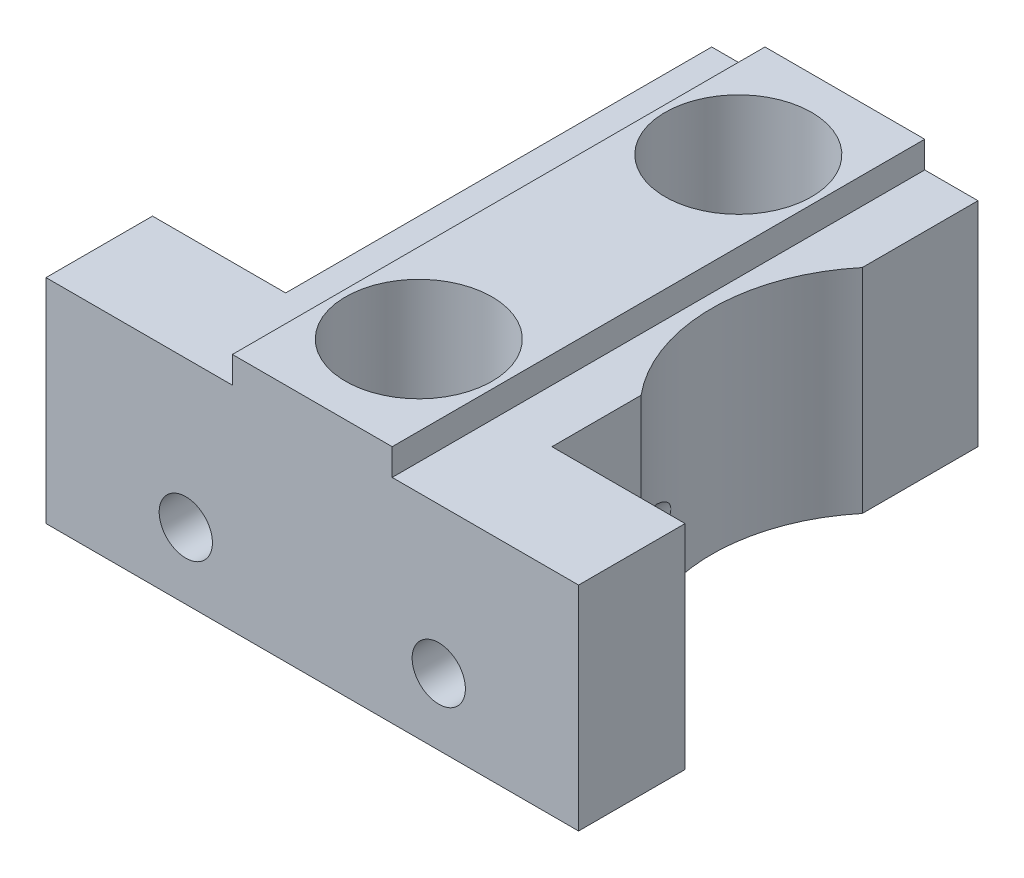
ISO-10303-21;
HEADER;
FILE_DESCRIPTION(('STEP AP214'),'2;1');
FILE_NAME('part.step','',(''),(''),'','','');
FILE_SCHEMA(('AUTOMOTIVE_DESIGN { 1 0 10303 214 1 1 1 1 }'));
ENDSEC;
DATA;
#1=APPLICATION_CONTEXT('core data for automotive mechanical design processes');
#2=APPLICATION_PROTOCOL_DEFINITION('international standard','automotive_design',2000,#1);
#3=PRODUCT_CONTEXT('',#1,'mechanical');
#4=PRODUCT('Part','Part','',(#3));
#5=PRODUCT_RELATED_PRODUCT_CATEGORY('part','',(#4));
#6=PRODUCT_DEFINITION_FORMATION('','',#4);
#7=PRODUCT_DEFINITION_CONTEXT('part definition',#1,'design');
#8=PRODUCT_DEFINITION('design','',#6,#7);
#9=PRODUCT_DEFINITION_SHAPE('','',#8);
#10=(LENGTH_UNIT() NAMED_UNIT(*) SI_UNIT(.MILLI.,.METRE.));
#11=(NAMED_UNIT(*) PLANE_ANGLE_UNIT() SI_UNIT($,.RADIAN.));
#12=(NAMED_UNIT(*) SI_UNIT($,.STERADIAN.) SOLID_ANGLE_UNIT());
#13=UNCERTAINTY_MEASURE_WITH_UNIT(LENGTH_MEASURE(1.E-05),#10,'distance_accuracy_value','');
#14=(GEOMETRIC_REPRESENTATION_CONTEXT(3) GLOBAL_UNCERTAINTY_ASSIGNED_CONTEXT((#13)) GLOBAL_UNIT_ASSIGNED_CONTEXT((#10,
#11,#12)) REPRESENTATION_CONTEXT('',''));
#15=CARTESIAN_POINT('',(0.,0.,0.));
#16=DIRECTION('',(0.,0.,1.));
#17=DIRECTION('',(1.,0.,0.));
#18=AXIS2_PLACEMENT_3D('',#15,#16,#17);
#19=CARTESIAN_POINT('',(5.,8.,-4.));
#20=DIRECTION('',(-1.,0.,0.));
#21=DIRECTION('',(0.,0.,1.));
#22=AXIS2_PLACEMENT_3D('',#19,#20,#21);
#23=PLANE('',#22);
#24=DIRECTION('',(0.,-1.,0.));
#25=VECTOR('',#24,1.);
#26=CARTESIAN_POINT('',(5.,9.,-7.34668806854097));
#27=LINE('',#26,#25);
#28=CARTESIAN_POINT('',(5.,0.,-7.34668806854097));
#29=VERTEX_POINT('',#28);
#30=CARTESIAN_POINT('',(5.,1.53175416344815,-7.34668806854097));
#31=VERTEX_POINT('',#30);
#32=EDGE_CURVE('E181',#29,#31,#27,.F.);
#33=ORIENTED_EDGE('',*,*,#32,.T.);
#34=DIRECTION('',(0.,0.,1.));
#35=VECTOR('',#34,1.);
#36=CARTESIAN_POINT('',(5.,1.53175416344815,-12.));
#37=LINE('',#36,#35);
#38=CARTESIAN_POINT('',(5.,1.53175416344815,-4.));
#39=VERTEX_POINT('',#38);
#40=EDGE_CURVE('E53',#31,#39,#37,.T.);
#41=ORIENTED_EDGE('',*,*,#40,.T.);
#42=DIRECTION('',(0.,-1.,0.));
#43=VECTOR('',#42,1.);
#44=CARTESIAN_POINT('',(5.,8.,-4.));
#45=LINE('',#44,#43);
#46=CARTESIAN_POINT('',(5.,0.,-4.));
#47=VERTEX_POINT('',#46);
#48=EDGE_CURVE('E271',#39,#47,#45,.T.);
#49=ORIENTED_EDGE('',*,*,#48,.T.);
#50=DIRECTION('',(0.,0.,-1.));
#51=VECTOR('',#50,1.);
#52=CARTESIAN_POINT('',(5.,0.,-4.));
#53=LINE('',#52,#51);
#54=EDGE_CURVE('E250',#47,#29,#53,.T.);
#55=ORIENTED_EDGE('',*,*,#54,.T.);
#56=EDGE_LOOP('',(#33,#41,#49,#55));
#57=FACE_BOUND('',#56,.T.);
#58=ADVANCED_FACE('F33',(#57),#23,.F.);
#59=DIRECTION('',(0.,0.,-1.));
#60=VECTOR('',#59,1.);
#61=CARTESIAN_POINT('',(5.,8.,-4.));
#62=LINE('',#61,#60);
#63=CARTESIAN_POINT('',(5.,8.,-15.653311931459));
#64=VERTEX_POINT('',#63);
#65=CARTESIAN_POINT('',(5.,8.,-20.));
#66=VERTEX_POINT('',#65);
#67=EDGE_CURVE('E229',#64,#66,#62,.T.);
#68=ORIENTED_EDGE('',*,*,#67,.F.);
#69=DIRECTION('',(0.,-1.,0.));
#70=VECTOR('',#69,1.);
#71=CARTESIAN_POINT('',(5.,9.,-15.653311931459));
#72=LINE('',#71,#70);
#73=CARTESIAN_POINT('',(5.,0.,-15.653311931459));
#74=VERTEX_POINT('',#73);
#75=EDGE_CURVE('E183',#64,#74,#72,.T.);
#76=ORIENTED_EDGE('',*,*,#75,.T.);
#77=CARTESIAN_POINT('',(5.,0.,-20.));
#78=VERTEX_POINT('',#77);
#79=EDGE_CURVE('E249',#74,#78,#53,.T.);
#80=ORIENTED_EDGE('',*,*,#79,.T.);
#81=DIRECTION('',(0.,-1.,0.));
#82=VECTOR('',#81,1.);
#83=CARTESIAN_POINT('',(5.,8.,-20.));
#84=LINE('',#83,#82);
#85=EDGE_CURVE('E268',#66,#78,#84,.T.);
#86=ORIENTED_EDGE('',*,*,#85,.F.);
#87=EDGE_LOOP('',(#68,#76,#80,#86));
#88=FACE_BOUND('',#87,.T.);
#89=ADVANCED_FACE('F317',(#88),#23,.F.);
#90=CARTESIAN_POINT('',(0.,8.,0.));
#91=DIRECTION('',(0.,1.,0.));
#92=DIRECTION('',(0.,0.,1.));
#93=AXIS2_PLACEMENT_3D('',#90,#91,#92);
#94=PLANE('',#93);
#95=DIRECTION('',(0.,0.,1.));
#96=VECTOR('',#95,1.);
#97=CARTESIAN_POINT('',(-3.,8.,-20.));
#98=LINE('',#97,#96);
#99=CARTESIAN_POINT('',(-3.,8.,-20.));
#100=VERTEX_POINT('',#99);
#101=CARTESIAN_POINT('',(-3.,8.,0.));
#102=VERTEX_POINT('',#101);
#103=EDGE_CURVE('E190',#100,#102,#98,.T.);
#104=ORIENTED_EDGE('',*,*,#103,.F.);
#105=DIRECTION('',(-1.,0.,0.));
#106=VECTOR('',#105,1.);
#107=CARTESIAN_POINT('',(5.,8.,-20.));
#108=LINE('',#107,#106);
#109=CARTESIAN_POINT('',(-5.,8.,-20.));
#110=VERTEX_POINT('',#109);
#111=EDGE_CURVE('E232',#100,#110,#108,.T.);
#112=ORIENTED_EDGE('',*,*,#111,.T.);
#113=DIRECTION('',(0.,0.,1.));
#114=VECTOR('',#113,1.);
#115=CARTESIAN_POINT('',(-5.,8.,-20.));
#116=LINE('',#115,#114);
#117=CARTESIAN_POINT('',(-5.,8.,-4.));
#118=VERTEX_POINT('',#117);
#119=EDGE_CURVE('E235',#110,#118,#116,.T.);
#120=ORIENTED_EDGE('',*,*,#119,.T.);
#121=DIRECTION('',(-1.,0.,0.));
#122=VECTOR('',#121,1.);
#123=CARTESIAN_POINT('',(-5.,8.,-4.));
#124=LINE('',#123,#122);
#125=CARTESIAN_POINT('',(-10.,8.,-4.));
#126=VERTEX_POINT('',#125);
#127=EDGE_CURVE('E237',#118,#126,#124,.T.);
#128=ORIENTED_EDGE('',*,*,#127,.T.);
#129=DIRECTION('',(0.,0.,1.));
#130=VECTOR('',#129,1.);
#131=CARTESIAN_POINT('',(-10.,8.,-4.));
#132=LINE('',#131,#130);
#133=CARTESIAN_POINT('',(-10.,8.,0.));
#134=VERTEX_POINT('',#133);
#135=EDGE_CURVE('E218',#126,#134,#132,.T.);
#136=ORIENTED_EDGE('',*,*,#135,.T.);
#137=DIRECTION('',(1.,0.,0.));
#138=VECTOR('',#137,1.);
#139=CARTESIAN_POINT('',(-10.,8.,0.));
#140=LINE('',#139,#138);
#141=EDGE_CURVE('E223',#134,#102,#140,.T.);
#142=ORIENTED_EDGE('',*,*,#141,.T.);
#143=EDGE_LOOP('',(#104,#112,#120,#128,#136,#142));
#144=FACE_BOUND('',#143,.T.);
#145=ADVANCED_FACE('F332',(#144),#94,.T.);
#146=CARTESIAN_POINT('',(-10.,8.,-4.));
#147=DIRECTION('',(1.,0.,0.));
#148=DIRECTION('',(0.,0.,-1.));
#149=AXIS2_PLACEMENT_3D('',#146,#147,#148);
#150=PLANE('',#149);
#151=DIRECTION('',(0.,0.,1.));
#152=VECTOR('',#151,1.);
#153=CARTESIAN_POINT('',(-10.,0.,-4.));
#154=LINE('',#153,#152);
#155=CARTESIAN_POINT('',(-10.,0.,-4.));
#156=VERTEX_POINT('',#155);
#157=CARTESIAN_POINT('',(-10.,0.,0.));
#158=VERTEX_POINT('',#157);
#159=EDGE_CURVE('E217',#156,#158,#154,.T.);
#160=ORIENTED_EDGE('',*,*,#159,.T.);
#161=DIRECTION('',(0.,-1.,0.));
#162=VECTOR('',#161,1.);
#163=CARTESIAN_POINT('',(-10.,8.,0.));
#164=LINE('',#163,#162);
#165=EDGE_CURVE('E279',#134,#158,#164,.T.);
#166=ORIENTED_EDGE('',*,*,#165,.F.);
#167=ORIENTED_EDGE('',*,*,#135,.F.);
#168=DIRECTION('',(0.,-1.,0.));
#169=VECTOR('',#168,1.);
#170=CARTESIAN_POINT('',(-10.,8.,-4.));
#171=LINE('',#170,#169);
#172=EDGE_CURVE('E239',#126,#156,#171,.T.);
#173=ORIENTED_EDGE('',*,*,#172,.T.);
#174=EDGE_LOOP('',(#160,#166,#167,#173));
#175=FACE_BOUND('',#174,.T.);
#176=ADVANCED_FACE('F35',(#175),#150,.F.);
#177=CARTESIAN_POINT('',(-10.,8.,0.));
#178=DIRECTION('',(0.,0.,-1.));
#179=DIRECTION('',(-1.,0.,0.));
#180=AXIS2_PLACEMENT_3D('',#177,#178,#179);
#181=PLANE('',#180);
#182=CARTESIAN_POINT('',(4.75,2.5,0.));
#183=DIRECTION('',(0.,0.,1.));
#184=DIRECTION('',(1.,0.,0.));
#185=AXIS2_PLACEMENT_3D('',#182,#183,#184);
#186=CIRCLE('',#185,1.);
#187=CARTESIAN_POINT('',(5.75,2.5,0.));
#188=VERTEX_POINT('',#187);
#189=EDGE_CURVE('E175',#188,#188,#186,.T.);
#190=ORIENTED_EDGE('',*,*,#189,.F.);
#191=EDGE_LOOP('',(#190));
#192=FACE_BOUND('',#191,.T.);
#193=CARTESIAN_POINT('',(-4.75,2.5,0.));
#194=DIRECTION('',(0.,0.,1.));
#195=DIRECTION('',(1.,0.,0.));
#196=AXIS2_PLACEMENT_3D('',#193,#194,#195);
#197=CIRCLE('',#196,1.);
#198=CARTESIAN_POINT('',(-3.75,2.5,0.));
#199=VERTEX_POINT('',#198);
#200=EDGE_CURVE('E292',#199,#199,#197,.T.);
#201=ORIENTED_EDGE('',*,*,#200,.F.);
#202=EDGE_LOOP('',(#201));
#203=FACE_BOUND('',#202,.T.);
#204=DIRECTION('',(1.,0.,0.));
#205=VECTOR('',#204,1.);
#206=CARTESIAN_POINT('',(-10.,0.,0.));
#207=LINE('',#206,#205);
#208=CARTESIAN_POINT('',(10.,0.,0.));
#209=VERTEX_POINT('',#208);
#210=EDGE_CURVE('E242',#158,#209,#207,.T.);
#211=ORIENTED_EDGE('',*,*,#210,.T.);
#212=DIRECTION('',(0.,-1.,0.));
#213=VECTOR('',#212,1.);
#214=CARTESIAN_POINT('',(10.,8.,0.));
#215=LINE('',#214,#213);
#216=CARTESIAN_POINT('',(10.,8.,0.));
#217=VERTEX_POINT('',#216);
#218=EDGE_CURVE('E276',#217,#209,#215,.T.);
#219=ORIENTED_EDGE('',*,*,#218,.F.);
#220=CARTESIAN_POINT('',(3.,8.,0.));
#221=VERTEX_POINT('',#220);
#222=EDGE_CURVE('E221',#221,#217,#140,.T.);
#223=ORIENTED_EDGE('',*,*,#222,.F.);
#224=DIRECTION('',(0.,-1.,0.));
#225=VECTOR('',#224,1.);
#226=CARTESIAN_POINT('',(3.,9.,0.));
#227=LINE('',#226,#225);
#228=CARTESIAN_POINT('',(3.,9.,0.));
#229=VERTEX_POINT('',#228);
#230=EDGE_CURVE('E211',#229,#221,#227,.T.);
#231=ORIENTED_EDGE('',*,*,#230,.F.);
#232=DIRECTION('',(1.,0.,0.));
#233=VECTOR('',#232,1.);
#234=CARTESIAN_POINT('',(-3.,9.,0.));
#235=LINE('',#234,#233);
#236=CARTESIAN_POINT('',(-3.,9.,0.));
#237=VERTEX_POINT('',#236);
#238=EDGE_CURVE('E194',#237,#229,#235,.T.);
#239=ORIENTED_EDGE('',*,*,#238,.F.);
#240=DIRECTION('',(0.,-1.,0.));
#241=VECTOR('',#240,1.);
#242=CARTESIAN_POINT('',(-3.,9.,0.));
#243=LINE('',#242,#241);
#244=EDGE_CURVE('E214',#237,#102,#243,.T.);
#245=ORIENTED_EDGE('',*,*,#244,.T.);
#246=ORIENTED_EDGE('',*,*,#141,.F.);
#247=ORIENTED_EDGE('',*,*,#165,.T.);
#248=EDGE_LOOP('',(#211,#219,#223,#231,#239,#245,#246,#247));
#249=FACE_BOUND('',#248,.T.);
#250=ADVANCED_FACE('F352',(#192,#203,#249),#181,.F.);
#251=CARTESIAN_POINT('',(10.,8.,0.));
#252=DIRECTION('',(-1.,0.,0.));
#253=DIRECTION('',(0.,0.,1.));
#254=AXIS2_PLACEMENT_3D('',#251,#252,#253);
#255=PLANE('',#254);
#256=DIRECTION('',(0.,0.,-1.));
#257=VECTOR('',#256,1.);
#258=CARTESIAN_POINT('',(10.,0.,0.));
#259=LINE('',#258,#257);
#260=CARTESIAN_POINT('',(10.,0.,-4.));
#261=VERTEX_POINT('',#260);
#262=EDGE_CURVE('E244',#209,#261,#259,.T.);
#263=ORIENTED_EDGE('',*,*,#262,.T.);
#264=DIRECTION('',(0.,-1.,0.));
#265=VECTOR('',#264,1.);
#266=CARTESIAN_POINT('',(10.,8.,-4.));
#267=LINE('',#266,#265);
#268=CARTESIAN_POINT('',(10.,8.,-4.));
#269=VERTEX_POINT('',#268);
#270=EDGE_CURVE('E273',#269,#261,#267,.T.);
#271=ORIENTED_EDGE('',*,*,#270,.F.);
#272=DIRECTION('',(0.,0.,-1.));
#273=VECTOR('',#272,1.);
#274=CARTESIAN_POINT('',(10.,8.,0.));
#275=LINE('',#274,#273);
#276=EDGE_CURVE('E225',#217,#269,#275,.T.);
#277=ORIENTED_EDGE('',*,*,#276,.F.);
#278=ORIENTED_EDGE('',*,*,#218,.T.);
#279=EDGE_LOOP('',(#263,#271,#277,#278));
#280=FACE_BOUND('',#279,.T.);
#281=ADVANCED_FACE('F357',(#280),#255,.F.);
#282=CARTESIAN_POINT('',(10.,8.,-4.));
#283=DIRECTION('',(0.,0.,1.));
#284=DIRECTION('',(1.,0.,0.));
#285=AXIS2_PLACEMENT_3D('',#282,#283,#284);
#286=PLANE('',#285);
#287=ORIENTED_EDGE('',*,*,#48,.F.);
#288=CARTESIAN_POINT('',(4.75,2.5,-4.));
#289=DIRECTION('',(0.,0.,1.));
#290=DIRECTION('',(1.,0.,0.));
#291=AXIS2_PLACEMENT_3D('',#288,#289,#290);
#292=CIRCLE('',#291,1.);
#293=CARTESIAN_POINT('',(5.,3.46824583655186,-4.));
#294=VERTEX_POINT('',#293);
#295=EDGE_CURVE('E362',#39,#294,#292,.T.);
#296=ORIENTED_EDGE('',*,*,#295,.T.);
#297=CARTESIAN_POINT('',(5.,8.,-4.));
#298=VERTEX_POINT('',#297);
#299=EDGE_CURVE('E174',#298,#294,#45,.T.);
#300=ORIENTED_EDGE('',*,*,#299,.F.);
#301=DIRECTION('',(-1.,0.,0.));
#302=VECTOR('',#301,1.);
#303=CARTESIAN_POINT('',(10.,8.,-4.));
#304=LINE('',#303,#302);
#305=EDGE_CURVE('E227',#269,#298,#304,.T.);
#306=ORIENTED_EDGE('',*,*,#305,.F.);
#307=ORIENTED_EDGE('',*,*,#270,.T.);
#308=DIRECTION('',(-1.,0.,0.));
#309=VECTOR('',#308,1.);
#310=CARTESIAN_POINT('',(10.,0.,-4.));
#311=LINE('',#310,#309);
#312=EDGE_CURVE('E246',#261,#47,#311,.T.);
#313=ORIENTED_EDGE('',*,*,#312,.T.);
#314=EDGE_LOOP('',(#287,#296,#300,#306,#307,#313));
#315=FACE_BOUND('',#314,.T.);
#316=ADVANCED_FACE('F361',(#315),#286,.F.);
#317=ORIENTED_EDGE('',*,*,#299,.T.);
#318=DIRECTION('',(0.,0.,1.));
#319=VECTOR('',#318,1.);
#320=CARTESIAN_POINT('',(5.,3.46824583655186,-12.));
#321=LINE('',#320,#319);
#322=CARTESIAN_POINT('',(5.,3.46824583655185,-7.34668806854097));
#323=VERTEX_POINT('',#322);
#324=EDGE_CURVE('E162',#294,#323,#321,.F.);
#325=ORIENTED_EDGE('',*,*,#324,.T.);
#326=CARTESIAN_POINT('',(5.,8.,-7.34668806854097));
#327=VERTEX_POINT('',#326);
#328=EDGE_CURVE('E171',#323,#327,#27,.F.);
#329=ORIENTED_EDGE('',*,*,#328,.T.);
#330=EDGE_CURVE('E230',#298,#327,#62,.T.);
#331=ORIENTED_EDGE('',*,*,#330,.F.);
#332=EDGE_LOOP('',(#317,#325,#329,#331));
#333=FACE_BOUND('',#332,.T.);
#334=ADVANCED_FACE('F169',(#333),#23,.F.);
#335=CARTESIAN_POINT('',(5.,8.,-20.));
#336=DIRECTION('',(0.,0.,1.));
#337=DIRECTION('',(1.,0.,0.));
#338=AXIS2_PLACEMENT_3D('',#335,#336,#337);
#339=PLANE('',#338);
#340=DIRECTION('',(-1.,0.,0.));
#341=VECTOR('',#340,1.);
#342=CARTESIAN_POINT('',(5.,0.,-20.));
#343=LINE('',#342,#341);
#344=CARTESIAN_POINT('',(-5.,0.,-20.));
#345=VERTEX_POINT('',#344);
#346=EDGE_CURVE('E253',#78,#345,#343,.T.);
#347=ORIENTED_EDGE('',*,*,#346,.T.);
#348=DIRECTION('',(0.,-1.,0.));
#349=VECTOR('',#348,1.);
#350=CARTESIAN_POINT('',(-5.,8.,-20.));
#351=LINE('',#350,#349);
#352=EDGE_CURVE('E265',#110,#345,#351,.T.);
#353=ORIENTED_EDGE('',*,*,#352,.F.);
#354=ORIENTED_EDGE('',*,*,#111,.F.);
#355=DIRECTION('',(0.,-1.,0.));
#356=VECTOR('',#355,1.);
#357=CARTESIAN_POINT('',(-3.,9.,-20.));
#358=LINE('',#357,#356);
#359=CARTESIAN_POINT('',(-3.,9.,-20.));
#360=VERTEX_POINT('',#359);
#361=EDGE_CURVE('E201',#360,#100,#358,.T.);
#362=ORIENTED_EDGE('',*,*,#361,.F.);
#363=DIRECTION('',(-1.,0.,0.));
#364=VECTOR('',#363,1.);
#365=CARTESIAN_POINT('',(-3.,9.,-20.));
#366=LINE('',#365,#364);
#367=CARTESIAN_POINT('',(3.,9.,-20.));
#368=VERTEX_POINT('',#367);
#369=EDGE_CURVE('E199',#368,#360,#366,.T.);
#370=ORIENTED_EDGE('',*,*,#369,.F.);
#371=DIRECTION('',(0.,-1.,0.));
#372=VECTOR('',#371,1.);
#373=CARTESIAN_POINT('',(3.,9.,-20.));
#374=LINE('',#373,#372);
#375=CARTESIAN_POINT('',(3.,8.,-20.));
#376=VERTEX_POINT('',#375);
#377=EDGE_CURVE('E208',#368,#376,#374,.T.);
#378=ORIENTED_EDGE('',*,*,#377,.T.);
#379=EDGE_CURVE('E233',#66,#376,#108,.T.);
#380=ORIENTED_EDGE('',*,*,#379,.F.);
#381=ORIENTED_EDGE('',*,*,#85,.T.);
#382=EDGE_LOOP('',(#347,#353,#354,#362,#370,#378,#380,#381));
#383=FACE_BOUND('',#382,.T.);
#384=ADVANCED_FACE('F325',(#383),#339,.F.);
#385=CARTESIAN_POINT('',(-5.,8.,-20.));
#386=DIRECTION('',(1.,0.,0.));
#387=DIRECTION('',(0.,0.,-1.));
#388=AXIS2_PLACEMENT_3D('',#385,#386,#387);
#389=PLANE('',#388);
#390=DIRECTION('',(0.,-1.,0.));
#391=VECTOR('',#390,1.);
#392=CARTESIAN_POINT('',(-5.,8.,-12.));
#393=LINE('',#392,#391);
#394=CARTESIAN_POINT('',(-5.,3.46824583655185,-12.));
#395=VERTEX_POINT('',#394);
#396=CARTESIAN_POINT('',(-5.,1.53175416344815,-12.));
#397=VERTEX_POINT('',#396);
#398=EDGE_CURVE('E46',#395,#397,#393,.T.);
#399=ORIENTED_EDGE('',*,*,#398,.F.);
#400=DIRECTION('',(0.,0.,1.));
#401=VECTOR('',#400,1.);
#402=CARTESIAN_POINT('',(-5.,3.46824583655185,-12.));
#403=LINE('',#402,#401);
#404=CARTESIAN_POINT('',(-5.,3.46824583655185,-4.));
#405=VERTEX_POINT('',#404);
#406=EDGE_CURVE('E291',#395,#405,#403,.T.);
#407=ORIENTED_EDGE('',*,*,#406,.T.);
#408=DIRECTION('',(0.,-1.,0.));
#409=VECTOR('',#408,1.);
#410=CARTESIAN_POINT('',(-5.,8.,-4.));
#411=LINE('',#410,#409);
#412=EDGE_CURVE('E262',#118,#405,#411,.T.);
#413=ORIENTED_EDGE('',*,*,#412,.F.);
#414=ORIENTED_EDGE('',*,*,#119,.F.);
#415=ORIENTED_EDGE('',*,*,#352,.T.);
#416=DIRECTION('',(0.,0.,1.));
#417=VECTOR('',#416,1.);
#418=CARTESIAN_POINT('',(-5.,0.,-20.));
#419=LINE('',#418,#417);
#420=CARTESIAN_POINT('',(-5.,0.,-4.));
#421=VERTEX_POINT('',#420);
#422=EDGE_CURVE('E255',#345,#421,#419,.T.);
#423=ORIENTED_EDGE('',*,*,#422,.T.);
#424=CARTESIAN_POINT('',(-5.,1.53175416344815,-4.));
#425=VERTEX_POINT('',#424);
#426=EDGE_CURVE('E261',#425,#421,#411,.T.);
#427=ORIENTED_EDGE('',*,*,#426,.F.);
#428=DIRECTION('',(0.,0.,1.));
#429=VECTOR('',#428,1.);
#430=CARTESIAN_POINT('',(-5.,1.53175416344815,-12.));
#431=LINE('',#430,#429);
#432=EDGE_CURVE('E60',#425,#397,#431,.F.);
#433=ORIENTED_EDGE('',*,*,#432,.T.);
#434=EDGE_LOOP('',(#399,#407,#413,#414,#415,#423,#427,#433));
#435=FACE_BOUND('',#434,.T.);
#436=ADVANCED_FACE('F295',(#435),#389,.F.);
#437=CARTESIAN_POINT('',(-5.,8.,-4.));
#438=DIRECTION('',(0.,0.,1.));
#439=DIRECTION('',(1.,0.,0.));
#440=AXIS2_PLACEMENT_3D('',#437,#438,#439);
#441=PLANE('',#440);
#442=ORIENTED_EDGE('',*,*,#412,.T.);
#443=CARTESIAN_POINT('',(-4.75,2.5,-4.));
#444=DIRECTION('',(0.,0.,1.));
#445=DIRECTION('',(1.,0.,0.));
#446=AXIS2_PLACEMENT_3D('',#443,#444,#445);
#447=CIRCLE('',#446,1.);
#448=EDGE_CURVE('E282',#405,#425,#447,.T.);
#449=ORIENTED_EDGE('',*,*,#448,.T.);
#450=ORIENTED_EDGE('',*,*,#426,.T.);
#451=DIRECTION('',(-1.,0.,0.));
#452=VECTOR('',#451,1.);
#453=CARTESIAN_POINT('',(-5.,0.,-4.));
#454=LINE('',#453,#452);
#455=EDGE_CURVE('E222',#421,#156,#454,.T.);
#456=ORIENTED_EDGE('',*,*,#455,.T.);
#457=ORIENTED_EDGE('',*,*,#172,.F.);
#458=ORIENTED_EDGE('',*,*,#127,.F.);
#459=EDGE_LOOP('',(#442,#449,#450,#456,#457,#458));
#460=FACE_BOUND('',#459,.T.);
#461=ADVANCED_FACE('F440',(#460),#441,.F.);
#462=CARTESIAN_POINT('',(10.,8.,-11.5));
#463=DIRECTION('',(0.,1.,0.));
#464=DIRECTION('',(0.,0.,1.));
#465=AXIS2_PLACEMENT_3D('',#462,#463,#464);
#466=CIRCLE('',#465,6.5);
#467=EDGE_CURVE('E179',#64,#327,#466,.T.);
#468=ORIENTED_EDGE('',*,*,#467,.F.);
#469=ORIENTED_EDGE('',*,*,#67,.T.);
#470=ORIENTED_EDGE('',*,*,#379,.T.);
#471=DIRECTION('',(0.,0.,-1.));
#472=VECTOR('',#471,1.);
#473=CARTESIAN_POINT('',(3.,8.,-20.));
#474=LINE('',#473,#472);
#475=EDGE_CURVE('E195',#221,#376,#474,.T.);
#476=ORIENTED_EDGE('',*,*,#475,.F.);
#477=ORIENTED_EDGE('',*,*,#222,.T.);
#478=ORIENTED_EDGE('',*,*,#276,.T.);
#479=ORIENTED_EDGE('',*,*,#305,.T.);
#480=ORIENTED_EDGE('',*,*,#330,.T.);
#481=EDGE_LOOP('',(#468,#469,#470,#476,#477,#478,#479,#480));
#482=FACE_BOUND('',#481,.T.);
#483=ADVANCED_FACE('F349',(#482),#94,.T.);
#484=CARTESIAN_POINT('',(0.,0.,0.));
#485=DIRECTION('',(0.,1.,0.));
#486=DIRECTION('',(0.,0.,1.));
#487=AXIS2_PLACEMENT_3D('',#484,#485,#486);
#488=PLANE('',#487);
#489=CARTESIAN_POINT('',(0.,0.,-16.));
#490=DIRECTION('',(0.,-1.,0.));
#491=DIRECTION('',(0.,0.,-1.));
#492=AXIS2_PLACEMENT_3D('',#489,#490,#491);
#493=CIRCLE('',#492,2.75);
#494=CARTESIAN_POINT('',(0.,0.,-18.75));
#495=VERTEX_POINT('',#494);
#496=EDGE_CURVE('E297',#495,#495,#493,.T.);
#497=ORIENTED_EDGE('',*,*,#496,.F.);
#498=EDGE_LOOP('',(#497));
#499=FACE_BOUND('',#498,.T.);
#500=CARTESIAN_POINT('',(0.,0.,-4.));
#501=DIRECTION('',(0.,-1.,0.));
#502=DIRECTION('',(0.,0.,-1.));
#503=AXIS2_PLACEMENT_3D('',#500,#501,#502);
#504=CIRCLE('',#503,2.75);
#505=CARTESIAN_POINT('',(0.,0.,-6.75));
#506=VERTEX_POINT('',#505);
#507=EDGE_CURVE('E304',#506,#506,#504,.T.);
#508=ORIENTED_EDGE('',*,*,#507,.F.);
#509=EDGE_LOOP('',(#508));
#510=FACE_BOUND('',#509,.T.);
#511=ORIENTED_EDGE('',*,*,#79,.F.);
#512=CARTESIAN_POINT('',(10.,0.,-11.5));
#513=DIRECTION('',(0.,-1.,0.));
#514=DIRECTION('',(0.,0.,-1.));
#515=AXIS2_PLACEMENT_3D('',#512,#513,#514);
#516=CIRCLE('',#515,6.5);
#517=EDGE_CURVE('E184',#29,#74,#516,.T.);
#518=ORIENTED_EDGE('',*,*,#517,.F.);
#519=ORIENTED_EDGE('',*,*,#54,.F.);
#520=ORIENTED_EDGE('',*,*,#312,.F.);
#521=ORIENTED_EDGE('',*,*,#262,.F.);
#522=ORIENTED_EDGE('',*,*,#210,.F.);
#523=ORIENTED_EDGE('',*,*,#159,.F.);
#524=ORIENTED_EDGE('',*,*,#455,.F.);
#525=ORIENTED_EDGE('',*,*,#422,.F.);
#526=ORIENTED_EDGE('',*,*,#346,.F.);
#527=EDGE_LOOP('',(#511,#518,#519,#520,#521,#522,#523,#524,#525,#526));
#528=FACE_BOUND('',#527,.T.);
#529=ADVANCED_FACE('F320',(#499,#510,#528),#488,.F.);
#530=CARTESIAN_POINT('',(-3.,9.,-20.));
#531=DIRECTION('',(1.,0.,0.));
#532=DIRECTION('',(0.,0.,-1.));
#533=AXIS2_PLACEMENT_3D('',#530,#531,#532);
#534=PLANE('',#533);
#535=ORIENTED_EDGE('',*,*,#103,.T.);
#536=ORIENTED_EDGE('',*,*,#244,.F.);
#537=DIRECTION('',(0.,0.,1.));
#538=VECTOR('',#537,1.);
#539=CARTESIAN_POINT('',(-3.,9.,-20.));
#540=LINE('',#539,#538);
#541=EDGE_CURVE('E191',#360,#237,#540,.T.);
#542=ORIENTED_EDGE('',*,*,#541,.F.);
#543=ORIENTED_EDGE('',*,*,#361,.T.);
#544=EDGE_LOOP('',(#535,#536,#542,#543));
#545=FACE_BOUND('',#544,.T.);
#546=ADVANCED_FACE('F338',(#545),#534,.F.);
#547=CARTESIAN_POINT('',(3.,9.,-20.));
#548=DIRECTION('',(-1.,0.,0.));
#549=DIRECTION('',(0.,0.,1.));
#550=AXIS2_PLACEMENT_3D('',#547,#548,#549);
#551=PLANE('',#550);
#552=ORIENTED_EDGE('',*,*,#475,.T.);
#553=ORIENTED_EDGE('',*,*,#377,.F.);
#554=DIRECTION('',(0.,0.,-1.));
#555=VECTOR('',#554,1.);
#556=CARTESIAN_POINT('',(3.,9.,-20.));
#557=LINE('',#556,#555);
#558=EDGE_CURVE('E197',#229,#368,#557,.T.);
#559=ORIENTED_EDGE('',*,*,#558,.F.);
#560=ORIENTED_EDGE('',*,*,#230,.T.);
#561=EDGE_LOOP('',(#552,#553,#559,#560));
#562=FACE_BOUND('',#561,.T.);
#563=ADVANCED_FACE('F346',(#562),#551,.F.);
#564=CARTESIAN_POINT('',(0.,9.,0.));
#565=DIRECTION('',(0.,1.,0.));
#566=DIRECTION('',(0.,0.,1.));
#567=AXIS2_PLACEMENT_3D('',#564,#565,#566);
#568=PLANE('',#567);
#569=CARTESIAN_POINT('',(0.,9.,-16.));
#570=DIRECTION('',(0.,-1.,0.));
#571=DIRECTION('',(0.,0.,-1.));
#572=AXIS2_PLACEMENT_3D('',#569,#570,#571);
#573=CIRCLE('',#572,2.75);
#574=CARTESIAN_POINT('',(0.,9.,-18.75));
#575=VERTEX_POINT('',#574);
#576=EDGE_CURVE('E301',#575,#575,#573,.T.);
#577=ORIENTED_EDGE('',*,*,#576,.T.);
#578=EDGE_LOOP('',(#577));
#579=FACE_BOUND('',#578,.T.);
#580=CARTESIAN_POINT('',(0.,9.,-4.));
#581=DIRECTION('',(0.,-1.,0.));
#582=DIRECTION('',(0.,0.,-1.));
#583=AXIS2_PLACEMENT_3D('',#580,#581,#582);
#584=CIRCLE('',#583,2.75);
#585=CARTESIAN_POINT('',(0.,9.,-6.75));
#586=VERTEX_POINT('',#585);
#587=EDGE_CURVE('E307',#586,#586,#584,.T.);
#588=ORIENTED_EDGE('',*,*,#587,.T.);
#589=EDGE_LOOP('',(#588));
#590=FACE_BOUND('',#589,.T.);
#591=ORIENTED_EDGE('',*,*,#541,.T.);
#592=ORIENTED_EDGE('',*,*,#238,.T.);
#593=ORIENTED_EDGE('',*,*,#558,.T.);
#594=ORIENTED_EDGE('',*,*,#369,.T.);
#595=EDGE_LOOP('',(#591,#592,#593,#594));
#596=FACE_BOUND('',#595,.T.);
#597=ADVANCED_FACE('F341',(#579,#590,#596),#568,.T.);
#598=CARTESIAN_POINT('',(10.,9.,-11.5));
#599=DIRECTION('',(0.,-1.,0.));
#600=DIRECTION('',(0.,0.,-1.));
#601=AXIS2_PLACEMENT_3D('',#598,#599,#600);
#602=CYLINDRICAL_SURFACE('',#601,6.5);
#603=ORIENTED_EDGE('',*,*,#328,.F.);
#604=CARTESIAN_POINT('',(5.,3.46824583655185,-7.34668806854097));
#605=CARTESIAN_POINT('',(4.95749998461447,3.47918977849781,-7.39783586932397));
#606=CARTESIAN_POINT('',(4.91552229313145,3.48707682638237,-7.44998366753919));
#607=CARTESIAN_POINT('',(4.83301447286365,3.49742044906203,-7.55579956616871));
#608=CARTESIAN_POINT('',(4.79248191489764,3.49988660487651,-7.6094648142335));
#609=CARTESIAN_POINT('',(4.71313880705732,3.50010549808064,-7.71798648567028));
#610=CARTESIAN_POINT('',(4.67432722173627,3.4978611100307,-7.77284216237838));
#611=CARTESIAN_POINT('',(4.5985532609517,3.48920122595923,-7.88352747775844));
#612=CARTESIAN_POINT('',(4.5615919971641,3.48278325407869,-7.93935767539352));
#613=CARTESIAN_POINT('',(4.4724070039969,3.46225095093571,-8.07867690164774));
#614=CARTESIAN_POINT('',(4.42135903566956,3.44592214519003,-8.16259701391657));
#615=CARTESIAN_POINT('',(4.32378682540103,3.40615648061259,-8.33138590051635));
#616=CARTESIAN_POINT('',(4.27726434059237,3.38271687526795,-8.41625502917948));
#617=CARTESIAN_POINT('',(4.18885292535766,3.32932474011766,-8.58628308433537));
#618=CARTESIAN_POINT('',(4.14696142783849,3.29937584619201,-8.67144182302676));
#619=CARTESIAN_POINT('',(4.0678531127052,3.23303999856469,-8.84135454376713));
#620=CARTESIAN_POINT('',(4.03063257553102,3.1966582238064,-8.92610879550582));
#621=CARTESIAN_POINT('',(3.9745710679564,3.13225832761767,-9.06129531843612));
#622=CARTESIAN_POINT('',(3.95423116584348,3.10652679055091,-9.11219861383004));
#623=CARTESIAN_POINT('',(3.91535449331207,3.05181214349333,-9.21307701669829));
#624=CARTESIAN_POINT('',(3.89682106452992,3.02282321338531,-9.26305027066945));
#625=CARTESIAN_POINT('',(3.86108939421157,2.95958542674927,-9.3630217648545));
#626=CARTESIAN_POINT('',(3.84396585286233,2.92518172398958,-9.41295261658371));
#627=CARTESIAN_POINT('',(3.82028111345733,2.86882233526922,-9.4846309418154));
#628=CARTESIAN_POINT('',(3.81273244984372,2.8492863820361,-9.50794492217149));
#629=CARTESIAN_POINT('',(3.79842340501899,2.80818436834371,-9.55295102186005));
#630=CARTESIAN_POINT('',(3.79166180038928,2.78662155540414,-9.57464563900403));
#631=CARTESIAN_POINT('',(3.7811702613333,2.7482459455161,-9.6088713451624));
#632=CARTESIAN_POINT('',(3.77716530824295,2.7321401142901,-9.62210330966855));
#633=CARTESIAN_POINT('',(3.76974514989631,2.69848877725897,-9.64686990656601));
#634=CARTESIAN_POINT('',(3.76633061653751,2.68094166432352,-9.65840260301317));
#635=CARTESIAN_POINT('',(3.76024387887369,2.64400732926066,-9.67913153267071));
#636=CARTESIAN_POINT('',(3.75758327511785,2.62459692720017,-9.68829108503471));
#637=CARTESIAN_POINT('',(3.75335898729688,2.58432735016813,-9.70290900121216));
#638=CARTESIAN_POINT('',(3.75179110275126,2.56347406559751,-9.7083815354188));
#639=CARTESIAN_POINT('',(3.75022820842499,2.5265424498468,-9.71384266438013));
#640=CARTESIAN_POINT('',(3.74993017174995,2.51063286143826,-9.71488737845677));
#641=CARTESIAN_POINT('',(3.75009741485834,2.47886259098564,-9.71430183291312));
#642=CARTESIAN_POINT('',(3.75056284726662,2.46300191935557,-9.71267103843276));
#643=CARTESIAN_POINT('',(3.75220210863169,2.43186874497915,-9.70694961584106));
#644=CARTESIAN_POINT('',(3.75337228710631,2.41659363984956,-9.70287166403678));
#645=CARTESIAN_POINT('',(3.75631369222778,2.38681007402021,-9.69267890986483));
#646=CARTESIAN_POINT('',(3.75808531663871,2.37230212803599,-9.68656275959139));
#647=CARTESIAN_POINT('',(3.76369346066674,2.33313775143404,-9.66734013664266));
#648=CARTESIAN_POINT('',(3.76806152381841,2.30941385135234,-9.6525067247423));
#649=CARTESIAN_POINT('',(3.77786625341635,2.2644385586387,-9.61974796511084));
#650=CARTESIAN_POINT('',(3.7833072800242,2.24319783727363,-9.60181003933918));
#651=CARTESIAN_POINT('',(3.79715049180363,2.1951792120853,-9.55696313261035));
#652=CARTESIAN_POINT('',(3.80589891779518,2.16930299441367,-9.52920871772446));
#653=CARTESIAN_POINT('',(3.82450470370093,2.12033838328235,-9.47165569275452));
#654=CARTESIAN_POINT('',(3.83436438193,2.09725603440575,-9.44185286168504));
#655=CARTESIAN_POINT('',(3.85505183758723,2.05316384689532,-9.38088403914031));
#656=CARTESIAN_POINT('',(3.86588345212594,2.03216297940533,-9.34971291729333));
#657=CARTESIAN_POINT('',(3.88839037133358,1.99190663438158,-9.28655125038979));
#658=CARTESIAN_POINT('',(3.90006604995581,1.97265193909279,-9.2545603462398));
#659=CARTESIAN_POINT('',(3.93834210371761,1.91388678806499,-9.15226053531966));
#660=CARTESIAN_POINT('',(3.96640806888959,1.87706178508701,-9.0809516120585));
#661=CARTESIAN_POINT('',(4.02603399792955,1.8086821314722,-8.93722617802668));
#662=CARTESIAN_POINT('',(4.0575977022028,1.77713321518085,-8.864808554341));
#663=CARTESIAN_POINT('',(4.12410059792945,1.71884529869173,-8.71968177987531));
#664=CARTESIAN_POINT('',(4.15903655615898,1.69210176027756,-8.64697297115625));
#665=CARTESIAN_POINT('',(4.23227370127683,1.64332410207697,-8.5016748379468));
#666=CARTESIAN_POINT('',(4.27057469695665,1.62128971495061,-8.42908550690591));
#667=CARTESIAN_POINT('',(4.34790115221625,1.58345997056981,-8.2891204027672));
#668=CARTESIAN_POINT('',(4.38671641196447,1.56735141189691,-8.22171339421522));
#669=CARTESIAN_POINT('',(4.46721621593399,1.53987365402801,-8.08760785573617));
#670=CARTESIAN_POINT('',(4.50890164478052,1.52850592370725,-8.02090955161922));
#671=CARTESIAN_POINT('',(4.59483909872005,1.51114241636256,-7.88884825810592));
#672=CARTESIAN_POINT('',(4.63908007733721,1.50512512754429,-7.82348096346928));
#673=CARTESIAN_POINT('',(4.73003911413928,1.49916191297868,-7.69424844205437));
#674=CARTESIAN_POINT('',(4.77675507567449,1.49921092791593,-7.63038200802182));
#675=CARTESIAN_POINT('',(4.85308347226216,1.5049150768787,-7.52992686795966));
#676=CARTESIAN_POINT('',(4.88202251363835,1.50830876109888,-7.49269302763384));
#677=CARTESIAN_POINT('',(4.94055849659319,1.51787729372976,-7.41903504749432));
#678=CARTESIAN_POINT('',(4.97015623437451,1.52405570361426,-7.38261200743343));
#679=CARTESIAN_POINT('',(5.,1.53175416344815,-7.34668806854097));
#680=B_SPLINE_CURVE_WITH_KNOTS('',3,(#604,#605,#606,#607,#608,#609,#610,#611,#612,#613,#614,
#615,#616,#617,#618,#619,#620,#621,#622,#623,#624,#625,#626,#627,#628,#629,#630,#631,#632,#633,
#634,#635,#636,#637,#638,#639,#640,#641,#642,#643,#644,#645,#646,#647,#648,#649,#650,#651,#652,
#653,#654,#655,#656,#657,#658,#659,#660,#661,#662,#663,#664,#665,#666,#667,#668,#669,#670,#671,
#672,#673,#674,#675,#676,#677,#678,#679),.UNSPECIFIED.,.F.,.F.,(4,2,2,2,2,2,2,2,2,2,2,2,2,2,2,2,
2,2,2,2,2,2,2,2,2,2,2,2,2,2,2,2,2,2,2,2,2,4),(0.,0.202010297425319,0.403663268775609,
0.605193219277183,0.806842830840725,1.10514315613748,1.40355884554259,1.70180827592703,
1.99981867782178,2.18138581930305,2.3632826935928,2.55190477790125,2.64584910826183,
2.73964540266846,2.80323156981416,2.86688962846044,2.93147971788918,2.99582012878153,
3.04342621826694,3.09104182583027,3.13841288763849,3.18581533935366,3.27027398809188,
3.35508319641648,3.47162354190469,3.58841168078234,3.70568308156939,3.82300676038289,
4.07772648302137,4.33272127497762,4.58747396849,4.84221219577045,5.08033500088986,
5.31853153010848,5.55576598703352,5.79280259104849,5.93455598377563,6.0764911861038),.UNSPECIFIED.);
#681=EDGE_CURVE('E11',#323,#31,#680,.T.);
#682=ORIENTED_EDGE('',*,*,#681,.T.);
#683=ORIENTED_EDGE('',*,*,#32,.F.);
#684=ORIENTED_EDGE('',*,*,#517,.T.);
#685=ORIENTED_EDGE('',*,*,#75,.F.);
#686=ORIENTED_EDGE('',*,*,#467,.T.);
#687=EDGE_LOOP('',(#603,#682,#683,#684,#685,#686));
#688=FACE_BOUND('',#687,.T.);
#689=ADVANCED_FACE('F177',(#688),#602,.F.);
#690=CARTESIAN_POINT('',(0.,9.,-4.));
#691=DIRECTION('',(0.,-1.,0.));
#692=DIRECTION('',(0.,0.,-1.));
#693=AXIS2_PLACEMENT_3D('',#690,#691,#692);
#694=CYLINDRICAL_SURFACE('',#693,2.75);
#695=ORIENTED_EDGE('',*,*,#587,.F.);
#696=EDGE_LOOP('',(#695));
#697=FACE_BOUND('',#696,.T.);
#698=ORIENTED_EDGE('',*,*,#507,.T.);
#699=EDGE_LOOP('',(#698));
#700=FACE_BOUND('',#699,.T.);
#701=ADVANCED_FACE('F465',(#697,#700),#694,.F.);
#702=CARTESIAN_POINT('',(0.,9.,-16.));
#703=DIRECTION('',(0.,-1.,0.));
#704=DIRECTION('',(0.,0.,-1.));
#705=AXIS2_PLACEMENT_3D('',#702,#703,#704);
#706=CYLINDRICAL_SURFACE('',#705,2.75);
#707=ORIENTED_EDGE('',*,*,#576,.F.);
#708=EDGE_LOOP('',(#707));
#709=FACE_BOUND('',#708,.T.);
#710=ORIENTED_EDGE('',*,*,#496,.T.);
#711=EDGE_LOOP('',(#710));
#712=FACE_BOUND('',#711,.T.);
#713=ADVANCED_FACE('F381',(#709,#712),#706,.F.);
#714=CARTESIAN_POINT('',(-4.75,2.5,-12.));
#715=DIRECTION('',(0.,0.,1.));
#716=DIRECTION('',(1.,0.,0.));
#717=AXIS2_PLACEMENT_3D('',#714,#715,#716);
#718=PLANE('',#717);
#719=ORIENTED_EDGE('',*,*,#398,.T.);
#720=CARTESIAN_POINT('',(-4.75,2.5,-12.));
#721=DIRECTION('',(0.,0.,1.));
#722=DIRECTION('',(1.,0.,0.));
#723=AXIS2_PLACEMENT_3D('',#720,#721,#722);
#724=CIRCLE('',#723,1.);
#725=EDGE_CURVE('E287',#397,#395,#724,.T.);
#726=ORIENTED_EDGE('',*,*,#725,.T.);
#727=EDGE_LOOP('',(#719,#726));
#728=FACE_BOUND('',#727,.T.);
#729=ADVANCED_FACE('F286',(#728),#718,.T.);
#730=CARTESIAN_POINT('',(-4.75,2.5,-12.));
#731=DIRECTION('',(0.,0.,1.));
#732=DIRECTION('',(1.,0.,0.));
#733=AXIS2_PLACEMENT_3D('',#730,#731,#732);
#734=CYLINDRICAL_SURFACE('',#733,1.);
#735=ORIENTED_EDGE('',*,*,#200,.T.);
#736=EDGE_LOOP('',(#735));
#737=FACE_BOUND('',#736,.T.);
#738=ORIENTED_EDGE('',*,*,#725,.F.);
#739=ORIENTED_EDGE('',*,*,#432,.F.);
#740=ORIENTED_EDGE('',*,*,#448,.F.);
#741=ORIENTED_EDGE('',*,*,#406,.F.);
#742=EDGE_LOOP('',(#738,#739,#740,#741));
#743=FACE_BOUND('',#742,.T.);
#744=ADVANCED_FACE('F290',(#737,#743),#734,.F.);
#745=CARTESIAN_POINT('',(4.75,2.5,-12.));
#746=DIRECTION('',(0.,0.,1.));
#747=DIRECTION('',(1.,0.,0.));
#748=AXIS2_PLACEMENT_3D('',#745,#746,#747);
#749=CYLINDRICAL_SURFACE('',#748,1.);
#750=ORIENTED_EDGE('',*,*,#189,.T.);
#751=EDGE_LOOP('',(#750));
#752=FACE_BOUND('',#751,.T.);
#753=ORIENTED_EDGE('',*,*,#40,.F.);
#754=ORIENTED_EDGE('',*,*,#681,.F.);
#755=ORIENTED_EDGE('',*,*,#324,.F.);
#756=ORIENTED_EDGE('',*,*,#295,.F.);
#757=EDGE_LOOP('',(#753,#754,#755,#756));
#758=FACE_BOUND('',#757,.T.);
#759=ADVANCED_FACE('F161',(#752,#758),#749,.F.);
#760=CLOSED_SHELL('',(#58,#89,#145,#176,#250,#281,#316,#334,#384,#436,#461,#483,#529,#546,#563,
#597,#689,#701,#713,#729,#744,#759));
#761=MANIFOLD_SOLID_BREP('B2',#760);
#762=ADVANCED_BREP_SHAPE_REPRESENTATION('',(#18,#761),#14);
#763=SHAPE_DEFINITION_REPRESENTATION(#9,#762);
ENDSEC;
END-ISO-10303-21;
